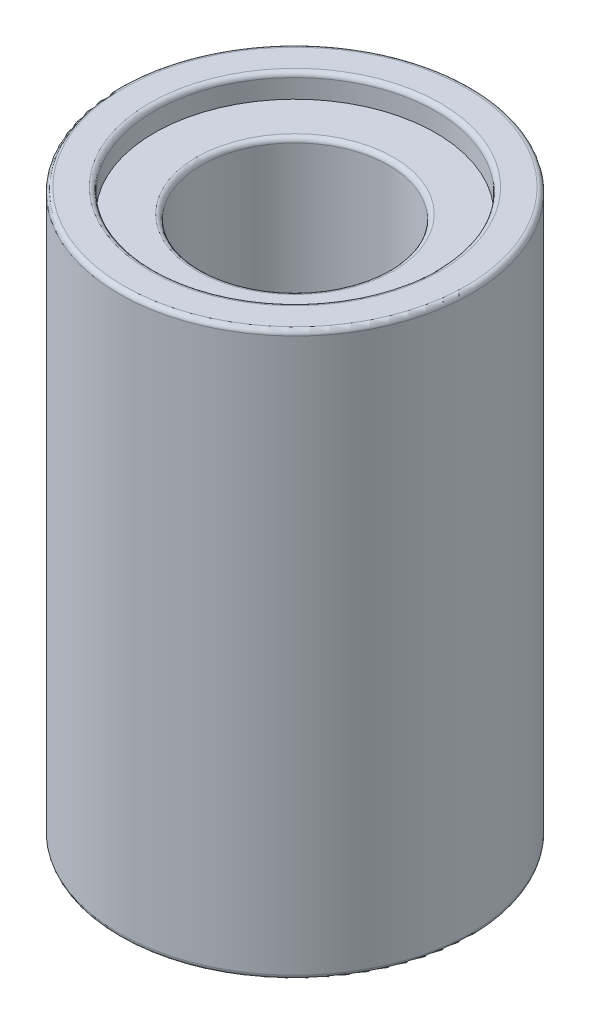
ISO-10303-21;
HEADER;
FILE_DESCRIPTION(('STEP AP214'),'2;1');
FILE_NAME('part.step','',(''),(''),'','','');
FILE_SCHEMA(('AUTOMOTIVE_DESIGN { 1 0 10303 214 1 1 1 1 }'));
ENDSEC;
DATA;
#1=APPLICATION_CONTEXT('core data for automotive mechanical design processes');
#2=APPLICATION_PROTOCOL_DEFINITION('international standard','automotive_design',2000,#1);
#3=PRODUCT_CONTEXT('',#1,'mechanical');
#4=PRODUCT('Part','Part','',(#3));
#5=PRODUCT_RELATED_PRODUCT_CATEGORY('part','',(#4));
#6=PRODUCT_DEFINITION_FORMATION('','',#4);
#7=PRODUCT_DEFINITION_CONTEXT('part definition',#1,'design');
#8=PRODUCT_DEFINITION('design','',#6,#7);
#9=PRODUCT_DEFINITION_SHAPE('','',#8);
#10=(LENGTH_UNIT() NAMED_UNIT(*) SI_UNIT(.MILLI.,.METRE.));
#11=(NAMED_UNIT(*) PLANE_ANGLE_UNIT() SI_UNIT($,.RADIAN.));
#12=(NAMED_UNIT(*) SI_UNIT($,.STERADIAN.) SOLID_ANGLE_UNIT());
#13=UNCERTAINTY_MEASURE_WITH_UNIT(LENGTH_MEASURE(1.E-05),#10,'distance_accuracy_value','');
#14=(GEOMETRIC_REPRESENTATION_CONTEXT(3) GLOBAL_UNCERTAINTY_ASSIGNED_CONTEXT((#13)) GLOBAL_UNIT_ASSIGNED_CONTEXT((#10,
#11,#12)) REPRESENTATION_CONTEXT('',''));
#15=CARTESIAN_POINT('',(0.,0.,0.));
#16=DIRECTION('',(0.,0.,1.));
#17=DIRECTION('',(1.,0.,0.));
#18=AXIS2_PLACEMENT_3D('',#15,#16,#17);
#19=CARTESIAN_POINT('',(0.,24.,0.));
#20=DIRECTION('',(0.,-1.,0.));
#21=DIRECTION('',(0.,0.,-1.));
#22=AXIS2_PLACEMENT_3D('',#19,#20,#21);
#23=CYLINDRICAL_SURFACE('',#22,6.);
#24=CARTESIAN_POINT('',(0.,0.199999999999999,0.));
#25=DIRECTION('',(0.,1.,0.));
#26=DIRECTION('',(0.,0.,1.));
#27=AXIS2_PLACEMENT_3D('',#24,#25,#26);
#28=CIRCLE('',#27,6.);
#29=CARTESIAN_POINT('',(0.,0.199999999999999,6.));
#30=VERTEX_POINT('',#29);
#31=EDGE_CURVE('E51',#30,#30,#28,.F.);
#32=ORIENTED_EDGE('',*,*,#31,.T.);
#33=EDGE_LOOP('',(#32));
#34=FACE_BOUND('',#33,.T.);
#35=CARTESIAN_POINT('',(0.,1.,0.));
#36=DIRECTION('',(0.,1.,0.));
#37=DIRECTION('',(0.,0.,1.));
#38=AXIS2_PLACEMENT_3D('',#35,#36,#37);
#39=CIRCLE('',#38,6.);
#40=CARTESIAN_POINT('',(0.,1.,6.));
#41=VERTEX_POINT('',#40);
#42=EDGE_CURVE('E78',#41,#41,#39,.T.);
#43=ORIENTED_EDGE('',*,*,#42,.T.);
#44=EDGE_LOOP('',(#43));
#45=FACE_BOUND('',#44,.T.);
#46=ADVANCED_FACE('F31',(#34,#45),#23,.F.);
#47=CARTESIAN_POINT('',(0.,24.,0.));
#48=DIRECTION('',(0.,1.,0.));
#49=DIRECTION('',(0.,0.,1.));
#50=AXIS2_PLACEMENT_3D('',#47,#48,#49);
#51=PLANE('',#50);
#52=CARTESIAN_POINT('',(0.,24.,0.));
#53=DIRECTION('',(0.,1.,0.));
#54=DIRECTION('',(0.,0.,1.));
#55=AXIS2_PLACEMENT_3D('',#52,#53,#54);
#56=CIRCLE('',#55,6.2);
#57=CARTESIAN_POINT('',(0.,24.,6.2));
#58=VERTEX_POINT('',#57);
#59=EDGE_CURVE('E66',#58,#58,#56,.F.);
#60=ORIENTED_EDGE('',*,*,#59,.T.);
#61=EDGE_LOOP('',(#60));
#62=FACE_BOUND('',#61,.T.);
#63=CARTESIAN_POINT('',(0.,24.,0.));
#64=DIRECTION('',(0.,1.,0.));
#65=DIRECTION('',(0.,0.,1.));
#66=AXIS2_PLACEMENT_3D('',#63,#64,#65);
#67=CIRCLE('',#66,7.3);
#68=CARTESIAN_POINT('',(0.,24.,7.3));
#69=VERTEX_POINT('',#68);
#70=EDGE_CURVE('E69',#69,#69,#67,.T.);
#71=ORIENTED_EDGE('',*,*,#70,.T.);
#72=EDGE_LOOP('',(#71));
#73=FACE_BOUND('',#72,.T.);
#74=ADVANCED_FACE('F100',(#62,#73),#51,.T.);
#75=CARTESIAN_POINT('',(0.,0.,0.));
#76=DIRECTION('',(0.,1.,0.));
#77=DIRECTION('',(0.,0.,1.));
#78=AXIS2_PLACEMENT_3D('',#75,#76,#77);
#79=PLANE('',#78);
#80=CARTESIAN_POINT('',(0.,0.,0.));
#81=DIRECTION('',(0.,1.,0.));
#82=DIRECTION('',(0.,0.,1.));
#83=AXIS2_PLACEMENT_3D('',#80,#81,#82);
#84=CIRCLE('',#83,6.2);
#85=CARTESIAN_POINT('',(0.,0.,6.2));
#86=VERTEX_POINT('',#85);
#87=EDGE_CURVE('E54',#86,#86,#84,.T.);
#88=ORIENTED_EDGE('',*,*,#87,.T.);
#89=EDGE_LOOP('',(#88));
#90=FACE_BOUND('',#89,.T.);
#91=CARTESIAN_POINT('',(0.,0.,0.));
#92=DIRECTION('',(0.,1.,0.));
#93=DIRECTION('',(0.,0.,1.));
#94=AXIS2_PLACEMENT_3D('',#91,#92,#93);
#95=CIRCLE('',#94,7.3);
#96=CARTESIAN_POINT('',(0.,0.,7.3));
#97=VERTEX_POINT('',#96);
#98=EDGE_CURVE('E57',#97,#97,#95,.F.);
#99=ORIENTED_EDGE('',*,*,#98,.T.);
#100=EDGE_LOOP('',(#99));
#101=FACE_BOUND('',#100,.T.);
#102=ADVANCED_FACE('F105',(#90,#101),#79,.F.);
#103=CARTESIAN_POINT('',(0.,24.,0.));
#104=DIRECTION('',(0.,-1.,0.));
#105=DIRECTION('',(0.,0.,-1.));
#106=AXIS2_PLACEMENT_3D('',#103,#104,#105);
#107=CYLINDRICAL_SURFACE('',#106,7.5);
#108=CARTESIAN_POINT('',(0.,23.8,0.));
#109=DIRECTION('',(0.,1.,0.));
#110=DIRECTION('',(0.,0.,1.));
#111=AXIS2_PLACEMENT_3D('',#108,#109,#110);
#112=CIRCLE('',#111,7.5);
#113=CARTESIAN_POINT('',(0.,23.8,7.5));
#114=VERTEX_POINT('',#113);
#115=EDGE_CURVE('E60',#114,#114,#112,.F.);
#116=ORIENTED_EDGE('',*,*,#115,.T.);
#117=EDGE_LOOP('',(#116));
#118=FACE_BOUND('',#117,.T.);
#119=CARTESIAN_POINT('',(0.,0.199999999999999,0.));
#120=DIRECTION('',(0.,1.,0.));
#121=DIRECTION('',(0.,0.,1.));
#122=AXIS2_PLACEMENT_3D('',#119,#120,#121);
#123=CIRCLE('',#122,7.5);
#124=CARTESIAN_POINT('',(0.,0.199999999999999,7.5));
#125=VERTEX_POINT('',#124);
#126=EDGE_CURVE('E63',#125,#125,#123,.T.);
#127=ORIENTED_EDGE('',*,*,#126,.T.);
#128=EDGE_LOOP('',(#127));
#129=FACE_BOUND('',#128,.T.);
#130=ADVANCED_FACE('F95',(#118,#129),#107,.T.);
#131=CARTESIAN_POINT('',(0.,23.8,0.));
#132=DIRECTION('',(0.,1.,0.));
#133=DIRECTION('',(0.,0.,1.));
#134=AXIS2_PLACEMENT_3D('',#131,#132,#133);
#135=CIRCLE('',#134,6.);
#136=CARTESIAN_POINT('',(0.,23.8,6.));
#137=VERTEX_POINT('',#136);
#138=EDGE_CURVE('E72',#137,#137,#135,.T.);
#139=ORIENTED_EDGE('',*,*,#138,.T.);
#140=EDGE_LOOP('',(#139));
#141=FACE_BOUND('',#140,.T.);
#142=CARTESIAN_POINT('',(0.,23.,0.));
#143=DIRECTION('',(0.,1.,0.));
#144=DIRECTION('',(0.,0.,1.));
#145=AXIS2_PLACEMENT_3D('',#142,#143,#144);
#146=CIRCLE('',#145,6.);
#147=CARTESIAN_POINT('',(0.,23.,6.));
#148=VERTEX_POINT('',#147);
#149=EDGE_CURVE('E75',#148,#148,#146,.T.);
#150=ORIENTED_EDGE('',*,*,#149,.F.);
#151=EDGE_LOOP('',(#150));
#152=FACE_BOUND('',#151,.T.);
#153=ADVANCED_FACE('F86',(#141,#152),#23,.F.);
#154=CARTESIAN_POINT('',(0.,1.,0.));
#155=DIRECTION('',(0.,1.,0.));
#156=DIRECTION('',(0.,0.,1.));
#157=AXIS2_PLACEMENT_3D('',#154,#155,#156);
#158=PLANE('',#157);
#159=CARTESIAN_POINT('',(0.,1.,0.));
#160=DIRECTION('',(0.,1.,0.));
#161=DIRECTION('',(0.,0.,1.));
#162=AXIS2_PLACEMENT_3D('',#159,#160,#161);
#163=CIRCLE('',#162,4.2);
#164=CARTESIAN_POINT('',(0.,1.,4.2));
#165=VERTEX_POINT('',#164);
#166=EDGE_CURVE('E46',#165,#165,#163,.T.);
#167=ORIENTED_EDGE('',*,*,#166,.T.);
#168=EDGE_LOOP('',(#167));
#169=FACE_BOUND('',#168,.T.);
#170=ORIENTED_EDGE('',*,*,#42,.F.);
#171=EDGE_LOOP('',(#170));
#172=FACE_BOUND('',#171,.T.);
#173=ADVANCED_FACE('F83',(#169,#172),#158,.F.);
#174=CARTESIAN_POINT('',(0.,23.,0.));
#175=DIRECTION('',(0.,1.,0.));
#176=DIRECTION('',(0.,0.,1.));
#177=AXIS2_PLACEMENT_3D('',#174,#175,#176);
#178=PLANE('',#177);
#179=CARTESIAN_POINT('',(0.,23.,0.));
#180=DIRECTION('',(0.,1.,0.));
#181=DIRECTION('',(0.,0.,1.));
#182=AXIS2_PLACEMENT_3D('',#179,#180,#181);
#183=CIRCLE('',#182,4.2);
#184=CARTESIAN_POINT('',(0.,23.,4.2));
#185=VERTEX_POINT('',#184);
#186=EDGE_CURVE('E10',#185,#185,#183,.F.);
#187=ORIENTED_EDGE('',*,*,#186,.T.);
#188=EDGE_LOOP('',(#187));
#189=FACE_BOUND('',#188,.T.);
#190=ORIENTED_EDGE('',*,*,#149,.T.);
#191=EDGE_LOOP('',(#190));
#192=FACE_BOUND('',#191,.T.);
#193=ADVANCED_FACE('F85',(#189,#192),#178,.T.);
#194=CARTESIAN_POINT('',(0.,1.,0.));
#195=DIRECTION('',(0.,1.,0.));
#196=DIRECTION('',(0.,0.,1.));
#197=AXIS2_PLACEMENT_3D('',#194,#195,#196);
#198=CYLINDRICAL_SURFACE('',#197,4.);
#199=CARTESIAN_POINT('',(0.,1.2,0.));
#200=DIRECTION('',(0.,1.,0.));
#201=DIRECTION('',(0.,0.,1.));
#202=AXIS2_PLACEMENT_3D('',#199,#200,#201);
#203=CIRCLE('',#202,4.);
#204=CARTESIAN_POINT('',(0.,1.2,4.));
#205=VERTEX_POINT('',#204);
#206=EDGE_CURVE('E38',#205,#205,#203,.F.);
#207=ORIENTED_EDGE('',*,*,#206,.T.);
#208=EDGE_LOOP('',(#207));
#209=FACE_BOUND('',#208,.T.);
#210=CARTESIAN_POINT('',(0.,22.8,0.));
#211=DIRECTION('',(0.,1.,0.));
#212=DIRECTION('',(0.,0.,1.));
#213=AXIS2_PLACEMENT_3D('',#210,#211,#212);
#214=CIRCLE('',#213,4.);
#215=CARTESIAN_POINT('',(0.,22.8,4.));
#216=VERTEX_POINT('',#215);
#217=EDGE_CURVE('E42',#216,#216,#214,.T.);
#218=ORIENTED_EDGE('',*,*,#217,.T.);
#219=EDGE_LOOP('',(#218));
#220=FACE_BOUND('',#219,.T.);
#221=ADVANCED_FACE('F93',(#209,#220),#198,.F.);
#222=CARTESIAN_POINT('',(0.,23.8,0.));
#223=DIRECTION('',(0.,1.,0.));
#224=DIRECTION('',(0.,0.,1.));
#225=AXIS2_PLACEMENT_3D('',#222,#223,#224);
#226=TOROIDAL_SURFACE('',#225,6.2,0.2);
#227=ORIENTED_EDGE('',*,*,#59,.F.);
#228=EDGE_LOOP('',(#227));
#229=FACE_BOUND('',#228,.T.);
#230=ORIENTED_EDGE('',*,*,#138,.F.);
#231=EDGE_LOOP('',(#230));
#232=FACE_BOUND('',#231,.T.);
#233=ADVANCED_FACE('F115',(#229,#232),#226,.T.);
#234=CARTESIAN_POINT('',(0.,23.8,0.));
#235=DIRECTION('',(0.,1.,0.));
#236=DIRECTION('',(0.,0.,1.));
#237=AXIS2_PLACEMENT_3D('',#234,#235,#236);
#238=TOROIDAL_SURFACE('',#237,7.3,0.2);
#239=ORIENTED_EDGE('',*,*,#115,.F.);
#240=EDGE_LOOP('',(#239));
#241=FACE_BOUND('',#240,.T.);
#242=ORIENTED_EDGE('',*,*,#70,.F.);
#243=EDGE_LOOP('',(#242));
#244=FACE_BOUND('',#243,.T.);
#245=ADVANCED_FACE('F118',(#241,#244),#238,.T.);
#246=CARTESIAN_POINT('',(0.,0.199999999999999,0.));
#247=DIRECTION('',(0.,1.,0.));
#248=DIRECTION('',(0.,0.,1.));
#249=AXIS2_PLACEMENT_3D('',#246,#247,#248);
#250=TOROIDAL_SURFACE('',#249,6.2,0.2);
#251=ORIENTED_EDGE('',*,*,#31,.F.);
#252=EDGE_LOOP('',(#251));
#253=FACE_BOUND('',#252,.T.);
#254=ORIENTED_EDGE('',*,*,#87,.F.);
#255=EDGE_LOOP('',(#254));
#256=FACE_BOUND('',#255,.T.);
#257=ADVANCED_FACE('F122',(#253,#256),#250,.T.);
#258=CARTESIAN_POINT('',(0.,0.199999999999999,0.));
#259=DIRECTION('',(0.,1.,0.));
#260=DIRECTION('',(0.,0.,1.));
#261=AXIS2_PLACEMENT_3D('',#258,#259,#260);
#262=TOROIDAL_SURFACE('',#261,7.3,0.2);
#263=ORIENTED_EDGE('',*,*,#98,.F.);
#264=EDGE_LOOP('',(#263));
#265=FACE_BOUND('',#264,.T.);
#266=ORIENTED_EDGE('',*,*,#126,.F.);
#267=EDGE_LOOP('',(#266));
#268=FACE_BOUND('',#267,.T.);
#269=ADVANCED_FACE('F126',(#265,#268),#262,.T.);
#270=CARTESIAN_POINT('',(0.,1.2,0.));
#271=DIRECTION('',(0.,1.,0.));
#272=DIRECTION('',(0.,0.,1.));
#273=AXIS2_PLACEMENT_3D('',#270,#271,#272);
#274=TOROIDAL_SURFACE('',#273,4.2,0.2);
#275=ORIENTED_EDGE('',*,*,#206,.F.);
#276=EDGE_LOOP('',(#275));
#277=FACE_BOUND('',#276,.T.);
#278=ORIENTED_EDGE('',*,*,#166,.F.);
#279=EDGE_LOOP('',(#278));
#280=FACE_BOUND('',#279,.T.);
#281=ADVANCED_FACE('F129',(#277,#280),#274,.T.);
#282=CARTESIAN_POINT('',(0.,22.8,0.));
#283=DIRECTION('',(0.,1.,0.));
#284=DIRECTION('',(0.,0.,1.));
#285=AXIS2_PLACEMENT_3D('',#282,#283,#284);
#286=TOROIDAL_SURFACE('',#285,4.2,0.2);
#287=ORIENTED_EDGE('',*,*,#186,.F.);
#288=EDGE_LOOP('',(#287));
#289=FACE_BOUND('',#288,.T.);
#290=ORIENTED_EDGE('',*,*,#217,.F.);
#291=EDGE_LOOP('',(#290));
#292=FACE_BOUND('',#291,.T.);
#293=ADVANCED_FACE('F33',(#289,#292),#286,.T.);
#294=CLOSED_SHELL('',(#46,#74,#102,#130,#153,#173,#193,#221,#233,#245,#257,#269,#281,#293));
#295=MANIFOLD_SOLID_BREP('B2',#294);
#296=ADVANCED_BREP_SHAPE_REPRESENTATION('',(#18,#295),#14);
#297=SHAPE_DEFINITION_REPRESENTATION(#9,#296);
ENDSEC;
END-ISO-10303-21;
